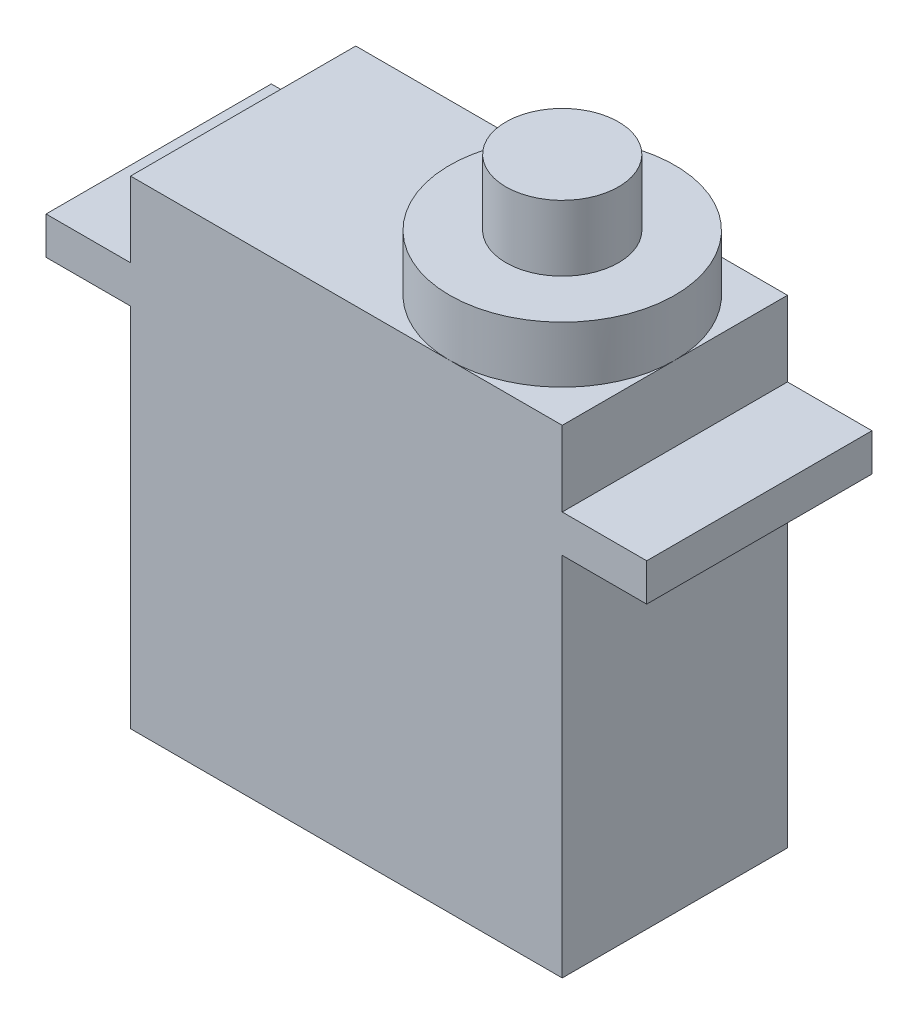
ISO-10303-21;
HEADER;
FILE_DESCRIPTION(('STEP AP214'),'2;1');
FILE_NAME('part.step','',(''),(''),'','','');
FILE_SCHEMA(('AUTOMOTIVE_DESIGN { 1 0 10303 214 1 1 1 1 }'));
ENDSEC;
DATA;
#1=APPLICATION_CONTEXT('core data for automotive mechanical design processes');
#2=APPLICATION_PROTOCOL_DEFINITION('international standard','automotive_design',2000,#1);
#3=PRODUCT_CONTEXT('',#1,'mechanical');
#4=PRODUCT('Part','Part','',(#3));
#5=PRODUCT_RELATED_PRODUCT_CATEGORY('part','',(#4));
#6=PRODUCT_DEFINITION_FORMATION('','',#4);
#7=PRODUCT_DEFINITION_CONTEXT('part definition',#1,'design');
#8=PRODUCT_DEFINITION('design','',#6,#7);
#9=PRODUCT_DEFINITION_SHAPE('','',#8);
#10=(LENGTH_UNIT() NAMED_UNIT(*) SI_UNIT(.MILLI.,.METRE.));
#11=(NAMED_UNIT(*) PLANE_ANGLE_UNIT() SI_UNIT($,.RADIAN.));
#12=(NAMED_UNIT(*) SI_UNIT($,.STERADIAN.) SOLID_ANGLE_UNIT());
#13=UNCERTAINTY_MEASURE_WITH_UNIT(LENGTH_MEASURE(1.E-05),#10,'distance_accuracy_value','');
#14=(GEOMETRIC_REPRESENTATION_CONTEXT(3) GLOBAL_UNCERTAINTY_ASSIGNED_CONTEXT((#13)) GLOBAL_UNIT_ASSIGNED_CONTEXT((#10,
#11,#12)) REPRESENTATION_CONTEXT('',''));
#15=CARTESIAN_POINT('',(0.,0.,0.));
#16=DIRECTION('',(0.,0.,1.));
#17=DIRECTION('',(1.,0.,0.));
#18=AXIS2_PLACEMENT_3D('',#15,#16,#17);
#19=CARTESIAN_POINT('',(0.,25.5,0.));
#20=DIRECTION('',(0.,-1.,0.));
#21=DIRECTION('',(0.,0.,-1.));
#22=AXIS2_PLACEMENT_3D('',#19,#20,#21);
#23=PLANE('',#22);
#24=CARTESIAN_POINT('',(17.,25.5,-6.));
#25=DIRECTION('',(0.,1.,0.));
#26=DIRECTION('',(0.,0.,1.));
#27=AXIS2_PLACEMENT_3D('',#24,#25,#26);
#28=CIRCLE('',#27,6.);
#29=CARTESIAN_POINT('',(17.,25.5,0.));
#30=VERTEX_POINT('',#29);
#31=CARTESIAN_POINT('',(23.,25.5,-6.));
#32=VERTEX_POINT('',#31);
#33=EDGE_CURVE('E153',#30,#32,#28,.T.);
#34=ORIENTED_EDGE('',*,*,#33,.F.);
#35=DIRECTION('',(1.,0.,0.));
#36=VECTOR('',#35,1.);
#37=CARTESIAN_POINT('',(0.,25.5,0.));
#38=LINE('',#37,#36);
#39=CARTESIAN_POINT('',(23.,25.5,0.));
#40=VERTEX_POINT('',#39);
#41=EDGE_CURVE('E141',#30,#40,#38,.T.);
#42=ORIENTED_EDGE('',*,*,#41,.T.);
#43=DIRECTION('',(0.,0.,-1.));
#44=VECTOR('',#43,1.);
#45=CARTESIAN_POINT('',(23.,25.5,0.));
#46=LINE('',#45,#44);
#47=EDGE_CURVE('E154',#40,#32,#46,.T.);
#48=ORIENTED_EDGE('',*,*,#47,.T.);
#49=EDGE_LOOP('',(#34,#42,#48));
#50=FACE_BOUND('',#49,.T.);
#51=ADVANCED_FACE('F34',(#50),#23,.F.);
#52=CARTESIAN_POINT('',(17.,25.5,-12.));
#53=VERTEX_POINT('',#52);
#54=EDGE_CURVE('E43',#32,#53,#28,.T.);
#55=ORIENTED_EDGE('',*,*,#54,.F.);
#56=CARTESIAN_POINT('',(23.,25.5,-12.));
#57=VERTEX_POINT('',#56);
#58=EDGE_CURVE('E140',#32,#57,#46,.T.);
#59=ORIENTED_EDGE('',*,*,#58,.T.);
#60=DIRECTION('',(-1.,0.,0.));
#61=VECTOR('',#60,1.);
#62=CARTESIAN_POINT('',(0.,25.5,-12.));
#63=LINE('',#62,#61);
#64=EDGE_CURVE('E168',#57,#53,#63,.T.);
#65=ORIENTED_EDGE('',*,*,#64,.T.);
#66=EDGE_LOOP('',(#55,#59,#65));
#67=FACE_BOUND('',#66,.T.);
#68=ADVANCED_FACE('F272',(#67),#23,.F.);
#69=CARTESIAN_POINT('',(0.,21.5,0.));
#70=DIRECTION('',(0.,1.,0.));
#71=DIRECTION('',(0.,0.,1.));
#72=AXIS2_PLACEMENT_3D('',#69,#70,#71);
#73=PLANE('',#72);
#74=DIRECTION('',(0.,0.,1.));
#75=VECTOR('',#74,1.);
#76=CARTESIAN_POINT('',(0.,21.5,0.));
#77=LINE('',#76,#75);
#78=CARTESIAN_POINT('',(0.,21.5,-12.));
#79=VERTEX_POINT('',#78);
#80=CARTESIAN_POINT('',(0.,21.5,0.));
#81=VERTEX_POINT('',#80);
#82=EDGE_CURVE('E171',#79,#81,#77,.T.);
#83=ORIENTED_EDGE('',*,*,#82,.F.);
#84=DIRECTION('',(1.,0.,0.));
#85=VECTOR('',#84,1.);
#86=CARTESIAN_POINT('',(0.,21.5,-12.));
#87=LINE('',#86,#85);
#88=CARTESIAN_POINT('',(-4.5,21.5,-12.));
#89=VERTEX_POINT('',#88);
#90=EDGE_CURVE('E185',#89,#79,#87,.T.);
#91=ORIENTED_EDGE('',*,*,#90,.F.);
#92=DIRECTION('',(0.,0.,-1.));
#93=VECTOR('',#92,1.);
#94=CARTESIAN_POINT('',(-4.5,21.5,0.));
#95=LINE('',#94,#93);
#96=CARTESIAN_POINT('',(-4.5,21.5,0.));
#97=VERTEX_POINT('',#96);
#98=EDGE_CURVE('E188',#97,#89,#95,.T.);
#99=ORIENTED_EDGE('',*,*,#98,.F.);
#100=DIRECTION('',(-1.,0.,0.));
#101=VECTOR('',#100,1.);
#102=CARTESIAN_POINT('',(0.,21.5,0.));
#103=LINE('',#102,#101);
#104=EDGE_CURVE('E192',#81,#97,#103,.T.);
#105=ORIENTED_EDGE('',*,*,#104,.F.);
#106=EDGE_LOOP('',(#83,#91,#99,#105));
#107=FACE_BOUND('',#106,.T.);
#108=ADVANCED_FACE('F266',(#107),#73,.T.);
#109=CARTESIAN_POINT('',(0.,19.5,0.));
#110=DIRECTION('',(1.,0.,0.));
#111=DIRECTION('',(0.,0.,-1.));
#112=AXIS2_PLACEMENT_3D('',#109,#110,#111);
#113=PLANE('',#112);
#114=DIRECTION('',(0.,0.,1.));
#115=VECTOR('',#114,1.);
#116=CARTESIAN_POINT('',(0.,0.,0.));
#117=LINE('',#116,#115);
#118=CARTESIAN_POINT('',(0.,0.,-12.));
#119=VERTEX_POINT('',#118);
#120=CARTESIAN_POINT('',(0.,0.,0.));
#121=VERTEX_POINT('',#120);
#122=EDGE_CURVE('E221',#119,#121,#117,.T.);
#123=ORIENTED_EDGE('',*,*,#122,.T.);
#124=DIRECTION('',(0.,-1.,0.));
#125=VECTOR('',#124,1.);
#126=CARTESIAN_POINT('',(0.,19.5,0.));
#127=LINE('',#126,#125);
#128=CARTESIAN_POINT('',(0.,19.5,0.));
#129=VERTEX_POINT('',#128);
#130=EDGE_CURVE('E38',#129,#121,#127,.T.);
#131=ORIENTED_EDGE('',*,*,#130,.F.);
#132=DIRECTION('',(0.,0.,1.));
#133=VECTOR('',#132,1.);
#134=CARTESIAN_POINT('',(0.,19.5,0.));
#135=LINE('',#134,#133);
#136=CARTESIAN_POINT('',(0.,19.5,-12.));
#137=VERTEX_POINT('',#136);
#138=EDGE_CURVE('E222',#137,#129,#135,.T.);
#139=ORIENTED_EDGE('',*,*,#138,.F.);
#140=DIRECTION('',(0.,-1.,0.));
#141=VECTOR('',#140,1.);
#142=CARTESIAN_POINT('',(0.,19.5,-12.));
#143=LINE('',#142,#141);
#144=EDGE_CURVE('E229',#137,#119,#143,.T.);
#145=ORIENTED_EDGE('',*,*,#144,.T.);
#146=EDGE_LOOP('',(#123,#131,#139,#145));
#147=FACE_BOUND('',#146,.T.);
#148=ADVANCED_FACE('F36',(#147),#113,.F.);
#149=CARTESIAN_POINT('',(0.,19.5,0.));
#150=DIRECTION('',(0.,0.,-1.));
#151=DIRECTION('',(-1.,0.,0.));
#152=AXIS2_PLACEMENT_3D('',#149,#150,#151);
#153=PLANE('',#152);
#154=DIRECTION('',(1.,0.,0.));
#155=VECTOR('',#154,1.);
#156=CARTESIAN_POINT('',(0.,0.,0.));
#157=LINE('',#156,#155);
#158=CARTESIAN_POINT('',(23.,0.,0.));
#159=VERTEX_POINT('',#158);
#160=EDGE_CURVE('E232',#121,#159,#157,.T.);
#161=ORIENTED_EDGE('',*,*,#160,.T.);
#162=DIRECTION('',(0.,-1.,0.));
#163=VECTOR('',#162,1.);
#164=CARTESIAN_POINT('',(23.,19.5,0.));
#165=LINE('',#164,#163);
#166=CARTESIAN_POINT('',(23.,19.5,0.));
#167=VERTEX_POINT('',#166);
#168=EDGE_CURVE('E161',#167,#159,#165,.T.);
#169=ORIENTED_EDGE('',*,*,#168,.F.);
#170=DIRECTION('',(-1.,0.,0.));
#171=VECTOR('',#170,1.);
#172=CARTESIAN_POINT('',(0.,19.5,0.));
#173=LINE('',#172,#171);
#174=CARTESIAN_POINT('',(27.5,19.5,0.));
#175=VERTEX_POINT('',#174);
#176=EDGE_CURVE('E206',#175,#167,#173,.T.);
#177=ORIENTED_EDGE('',*,*,#176,.F.);
#178=DIRECTION('',(0.,-1.,0.));
#179=VECTOR('',#178,1.);
#180=CARTESIAN_POINT('',(27.5,21.5,0.));
#181=LINE('',#180,#179);
#182=CARTESIAN_POINT('',(27.5,21.5,0.));
#183=VERTEX_POINT('',#182);
#184=EDGE_CURVE('E214',#183,#175,#181,.T.);
#185=ORIENTED_EDGE('',*,*,#184,.F.);
#186=CARTESIAN_POINT('',(23.,21.5,0.));
#187=VERTEX_POINT('',#186);
#188=EDGE_CURVE('E193',#183,#187,#103,.T.);
#189=ORIENTED_EDGE('',*,*,#188,.T.);
#190=DIRECTION('',(0.,-1.,0.));
#191=VECTOR('',#190,1.);
#192=CARTESIAN_POINT('',(23.,25.5,0.));
#193=LINE('',#192,#191);
#194=EDGE_CURVE('E148',#40,#187,#193,.T.);
#195=ORIENTED_EDGE('',*,*,#194,.F.);
#196=ORIENTED_EDGE('',*,*,#41,.F.);
#197=CARTESIAN_POINT('',(0.,25.5,0.));
#198=VERTEX_POINT('',#197);
#199=EDGE_CURVE('E132',#198,#30,#38,.T.);
#200=ORIENTED_EDGE('',*,*,#199,.F.);
#201=DIRECTION('',(0.,-1.,0.));
#202=VECTOR('',#201,1.);
#203=CARTESIAN_POINT('',(0.,25.5,0.));
#204=LINE('',#203,#202);
#205=EDGE_CURVE('E182',#198,#81,#204,.T.);
#206=ORIENTED_EDGE('',*,*,#205,.T.);
#207=ORIENTED_EDGE('',*,*,#104,.T.);
#208=DIRECTION('',(0.,-1.,0.));
#209=VECTOR('',#208,1.);
#210=CARTESIAN_POINT('',(-4.5,21.5,0.));
#211=LINE('',#210,#209);
#212=CARTESIAN_POINT('',(-4.5,19.5,0.));
#213=VERTEX_POINT('',#212);
#214=EDGE_CURVE('E216',#97,#213,#211,.T.);
#215=ORIENTED_EDGE('',*,*,#214,.T.);
#216=EDGE_CURVE('E205',#129,#213,#173,.T.);
#217=ORIENTED_EDGE('',*,*,#216,.F.);
#218=ORIENTED_EDGE('',*,*,#130,.T.);
#219=EDGE_LOOP('',(#161,#169,#177,#185,#189,#195,#196,#200,#206,#207,#215,#217,#218));
#220=FACE_BOUND('',#219,.T.);
#221=ADVANCED_FACE('F145',(#220),#153,.F.);
#222=CARTESIAN_POINT('',(23.,19.5,0.));
#223=DIRECTION('',(-1.,0.,0.));
#224=DIRECTION('',(0.,0.,1.));
#225=AXIS2_PLACEMENT_3D('',#222,#223,#224);
#226=PLANE('',#225);
#227=DIRECTION('',(0.,0.,-1.));
#228=VECTOR('',#227,1.);
#229=CARTESIAN_POINT('',(23.,0.,0.));
#230=LINE('',#229,#228);
#231=CARTESIAN_POINT('',(23.,0.,-12.));
#232=VERTEX_POINT('',#231);
#233=EDGE_CURVE('E234',#159,#232,#230,.T.);
#234=ORIENTED_EDGE('',*,*,#233,.T.);
#235=DIRECTION('',(0.,-1.,0.));
#236=VECTOR('',#235,1.);
#237=CARTESIAN_POINT('',(23.,19.5,-12.));
#238=LINE('',#237,#236);
#239=CARTESIAN_POINT('',(23.,19.5,-12.));
#240=VERTEX_POINT('',#239);
#241=EDGE_CURVE('E239',#240,#232,#238,.T.);
#242=ORIENTED_EDGE('',*,*,#241,.F.);
#243=DIRECTION('',(0.,0.,-1.));
#244=VECTOR('',#243,1.);
#245=CARTESIAN_POINT('',(23.,19.5,0.));
#246=LINE('',#245,#244);
#247=EDGE_CURVE('E225',#167,#240,#246,.T.);
#248=ORIENTED_EDGE('',*,*,#247,.F.);
#249=ORIENTED_EDGE('',*,*,#168,.T.);
#250=EDGE_LOOP('',(#234,#242,#248,#249));
#251=FACE_BOUND('',#250,.T.);
#252=ADVANCED_FACE('F245',(#251),#226,.F.);
#253=CARTESIAN_POINT('',(0.,19.5,-12.));
#254=DIRECTION('',(0.,0.,1.));
#255=DIRECTION('',(1.,0.,0.));
#256=AXIS2_PLACEMENT_3D('',#253,#254,#255);
#257=PLANE('',#256);
#258=DIRECTION('',(-1.,0.,0.));
#259=VECTOR('',#258,1.);
#260=CARTESIAN_POINT('',(0.,0.,-12.));
#261=LINE('',#260,#259);
#262=EDGE_CURVE('E226',#232,#119,#261,.T.);
#263=ORIENTED_EDGE('',*,*,#262,.T.);
#264=ORIENTED_EDGE('',*,*,#144,.F.);
#265=DIRECTION('',(1.,0.,0.));
#266=VECTOR('',#265,1.);
#267=CARTESIAN_POINT('',(0.,19.5,-12.));
#268=LINE('',#267,#266);
#269=CARTESIAN_POINT('',(-4.5,19.5,-12.));
#270=VERTEX_POINT('',#269);
#271=EDGE_CURVE('E199',#270,#137,#268,.T.);
#272=ORIENTED_EDGE('',*,*,#271,.F.);
#273=DIRECTION('',(0.,-1.,0.));
#274=VECTOR('',#273,1.);
#275=CARTESIAN_POINT('',(-4.5,21.5,-12.));
#276=LINE('',#275,#274);
#277=EDGE_CURVE('E219',#89,#270,#276,.T.);
#278=ORIENTED_EDGE('',*,*,#277,.F.);
#279=ORIENTED_EDGE('',*,*,#90,.T.);
#280=DIRECTION('',(0.,-1.,0.));
#281=VECTOR('',#280,1.);
#282=CARTESIAN_POINT('',(0.,25.5,-12.));
#283=LINE('',#282,#281);
#284=CARTESIAN_POINT('',(0.,25.5,-12.));
#285=VERTEX_POINT('',#284);
#286=EDGE_CURVE('E170',#285,#79,#283,.T.);
#287=ORIENTED_EDGE('',*,*,#286,.F.);
#288=EDGE_CURVE('E167',#53,#285,#63,.T.);
#289=ORIENTED_EDGE('',*,*,#288,.F.);
#290=ORIENTED_EDGE('',*,*,#64,.F.);
#291=DIRECTION('',(0.,-1.,0.));
#292=VECTOR('',#291,1.);
#293=CARTESIAN_POINT('',(23.,25.5,-12.));
#294=LINE('',#293,#292);
#295=CARTESIAN_POINT('',(23.,21.5,-12.));
#296=VERTEX_POINT('',#295);
#297=EDGE_CURVE('E178',#57,#296,#294,.T.);
#298=ORIENTED_EDGE('',*,*,#297,.T.);
#299=CARTESIAN_POINT('',(27.5,21.5,-12.));
#300=VERTEX_POINT('',#299);
#301=EDGE_CURVE('E189',#296,#300,#87,.T.);
#302=ORIENTED_EDGE('',*,*,#301,.T.);
#303=DIRECTION('',(0.,-1.,0.));
#304=VECTOR('',#303,1.);
#305=CARTESIAN_POINT('',(27.5,21.5,-12.));
#306=LINE('',#305,#304);
#307=CARTESIAN_POINT('',(27.5,19.5,-12.));
#308=VERTEX_POINT('',#307);
#309=EDGE_CURVE('E198',#300,#308,#306,.T.);
#310=ORIENTED_EDGE('',*,*,#309,.T.);
#311=EDGE_CURVE('E184',#240,#308,#268,.T.);
#312=ORIENTED_EDGE('',*,*,#311,.F.);
#313=ORIENTED_EDGE('',*,*,#241,.T.);
#314=EDGE_LOOP('',(#263,#264,#272,#278,#279,#287,#289,#290,#298,#302,#310,#312,#313));
#315=FACE_BOUND('',#314,.T.);
#316=ADVANCED_FACE('F252',(#315),#257,.F.);
#317=CARTESIAN_POINT('',(0.,0.,0.));
#318=DIRECTION('',(0.,-1.,0.));
#319=DIRECTION('',(0.,0.,-1.));
#320=AXIS2_PLACEMENT_3D('',#317,#318,#319);
#321=PLANE('',#320);
#322=ORIENTED_EDGE('',*,*,#122,.F.);
#323=ORIENTED_EDGE('',*,*,#262,.F.);
#324=ORIENTED_EDGE('',*,*,#233,.F.);
#325=ORIENTED_EDGE('',*,*,#160,.F.);
#326=EDGE_LOOP('',(#322,#323,#324,#325));
#327=FACE_BOUND('',#326,.T.);
#328=ADVANCED_FACE('F250',(#327),#321,.T.);
#329=CARTESIAN_POINT('',(0.,19.5,0.));
#330=DIRECTION('',(0.,1.,0.));
#331=DIRECTION('',(0.,0.,1.));
#332=AXIS2_PLACEMENT_3D('',#329,#330,#331);
#333=PLANE('',#332);
#334=ORIENTED_EDGE('',*,*,#271,.T.);
#335=ORIENTED_EDGE('',*,*,#138,.T.);
#336=ORIENTED_EDGE('',*,*,#216,.T.);
#337=DIRECTION('',(0.,0.,-1.));
#338=VECTOR('',#337,1.);
#339=CARTESIAN_POINT('',(-4.5,19.5,0.));
#340=LINE('',#339,#338);
#341=EDGE_CURVE('E202',#213,#270,#340,.T.);
#342=ORIENTED_EDGE('',*,*,#341,.T.);
#343=EDGE_LOOP('',(#334,#335,#336,#342));
#344=FACE_BOUND('',#343,.T.);
#345=ADVANCED_FACE('F259',(#344),#333,.F.);
#346=ORIENTED_EDGE('',*,*,#176,.T.);
#347=ORIENTED_EDGE('',*,*,#247,.T.);
#348=ORIENTED_EDGE('',*,*,#311,.T.);
#349=DIRECTION('',(0.,0.,1.));
#350=VECTOR('',#349,1.);
#351=CARTESIAN_POINT('',(27.5,19.5,0.));
#352=LINE('',#351,#350);
#353=EDGE_CURVE('E209',#308,#175,#352,.T.);
#354=ORIENTED_EDGE('',*,*,#353,.T.);
#355=EDGE_LOOP('',(#346,#347,#348,#354));
#356=FACE_BOUND('',#355,.T.);
#357=ADVANCED_FACE('F285',(#356),#333,.F.);
#358=CARTESIAN_POINT('',(-4.5,21.5,0.));
#359=DIRECTION('',(-1.,0.,0.));
#360=DIRECTION('',(0.,0.,1.));
#361=AXIS2_PLACEMENT_3D('',#358,#359,#360);
#362=PLANE('',#361);
#363=ORIENTED_EDGE('',*,*,#341,.F.);
#364=ORIENTED_EDGE('',*,*,#214,.F.);
#365=ORIENTED_EDGE('',*,*,#98,.T.);
#366=ORIENTED_EDGE('',*,*,#277,.T.);
#367=EDGE_LOOP('',(#363,#364,#365,#366));
#368=FACE_BOUND('',#367,.T.);
#369=ADVANCED_FACE('F268',(#368),#362,.T.);
#370=CARTESIAN_POINT('',(27.5,21.5,0.));
#371=DIRECTION('',(1.,0.,0.));
#372=DIRECTION('',(0.,0.,-1.));
#373=AXIS2_PLACEMENT_3D('',#370,#371,#372);
#374=PLANE('',#373);
#375=ORIENTED_EDGE('',*,*,#353,.F.);
#376=ORIENTED_EDGE('',*,*,#309,.F.);
#377=DIRECTION('',(0.,0.,1.));
#378=VECTOR('',#377,1.);
#379=CARTESIAN_POINT('',(27.5,21.5,0.));
#380=LINE('',#379,#378);
#381=EDGE_CURVE('E195',#300,#183,#380,.T.);
#382=ORIENTED_EDGE('',*,*,#381,.T.);
#383=ORIENTED_EDGE('',*,*,#184,.T.);
#384=EDGE_LOOP('',(#375,#376,#382,#383));
#385=FACE_BOUND('',#384,.T.);
#386=ADVANCED_FACE('F281',(#385),#374,.T.);
#387=DIRECTION('',(0.,0.,-1.));
#388=VECTOR('',#387,1.);
#389=CARTESIAN_POINT('',(23.,21.5,0.));
#390=LINE('',#389,#388);
#391=EDGE_CURVE('E164',#187,#296,#390,.T.);
#392=ORIENTED_EDGE('',*,*,#391,.F.);
#393=ORIENTED_EDGE('',*,*,#188,.F.);
#394=ORIENTED_EDGE('',*,*,#381,.F.);
#395=ORIENTED_EDGE('',*,*,#301,.F.);
#396=EDGE_LOOP('',(#392,#393,#394,#395));
#397=FACE_BOUND('',#396,.T.);
#398=ADVANCED_FACE('F283',(#397),#73,.T.);
#399=CARTESIAN_POINT('',(0.,25.5,0.));
#400=DIRECTION('',(1.,0.,0.));
#401=DIRECTION('',(0.,0.,-1.));
#402=AXIS2_PLACEMENT_3D('',#399,#400,#401);
#403=PLANE('',#402);
#404=ORIENTED_EDGE('',*,*,#82,.T.);
#405=ORIENTED_EDGE('',*,*,#205,.F.);
#406=DIRECTION('',(0.,0.,1.));
#407=VECTOR('',#406,1.);
#408=CARTESIAN_POINT('',(0.,25.5,0.));
#409=LINE('',#408,#407);
#410=EDGE_CURVE('E136',#285,#198,#409,.T.);
#411=ORIENTED_EDGE('',*,*,#410,.F.);
#412=ORIENTED_EDGE('',*,*,#286,.T.);
#413=EDGE_LOOP('',(#404,#405,#411,#412));
#414=FACE_BOUND('',#413,.T.);
#415=ADVANCED_FACE('F270',(#414),#403,.F.);
#416=CARTESIAN_POINT('',(23.,25.5,0.));
#417=DIRECTION('',(-1.,0.,0.));
#418=DIRECTION('',(0.,0.,1.));
#419=AXIS2_PLACEMENT_3D('',#416,#417,#418);
#420=PLANE('',#419);
#421=ORIENTED_EDGE('',*,*,#391,.T.);
#422=ORIENTED_EDGE('',*,*,#297,.F.);
#423=ORIENTED_EDGE('',*,*,#58,.F.);
#424=ORIENTED_EDGE('',*,*,#47,.F.);
#425=ORIENTED_EDGE('',*,*,#194,.T.);
#426=EDGE_LOOP('',(#421,#422,#423,#424,#425));
#427=FACE_BOUND('',#426,.T.);
#428=ADVANCED_FACE('F275',(#427),#420,.F.);
#429=EDGE_CURVE('E51',#53,#30,#28,.T.);
#430=ORIENTED_EDGE('',*,*,#429,.F.);
#431=ORIENTED_EDGE('',*,*,#288,.T.);
#432=ORIENTED_EDGE('',*,*,#410,.T.);
#433=ORIENTED_EDGE('',*,*,#199,.T.);
#434=EDGE_LOOP('',(#430,#431,#432,#433));
#435=FACE_BOUND('',#434,.T.);
#436=ADVANCED_FACE('F134',(#435),#23,.F.);
#437=CARTESIAN_POINT('',(17.,28.5,-6.));
#438=DIRECTION('',(0.,-1.,0.));
#439=DIRECTION('',(0.,0.,-1.));
#440=AXIS2_PLACEMENT_3D('',#437,#438,#439);
#441=CYLINDRICAL_SURFACE('',#440,6.);
#442=CARTESIAN_POINT('',(17.,28.5,-6.));
#443=DIRECTION('',(0.,1.,0.));
#444=DIRECTION('',(0.,0.,1.));
#445=AXIS2_PLACEMENT_3D('',#442,#443,#444);
#446=CIRCLE('',#445,6.);
#447=CARTESIAN_POINT('',(17.,28.5,0.));
#448=VERTEX_POINT('',#447);
#449=EDGE_CURVE('E156',#448,#448,#446,.T.);
#450=ORIENTED_EDGE('',*,*,#449,.F.);
#451=EDGE_LOOP('',(#450));
#452=FACE_BOUND('',#451,.T.);
#453=ORIENTED_EDGE('',*,*,#33,.T.);
#454=ORIENTED_EDGE('',*,*,#54,.T.);
#455=ORIENTED_EDGE('',*,*,#429,.T.);
#456=EDGE_LOOP('',(#453,#454,#455));
#457=FACE_BOUND('',#456,.T.);
#458=ADVANCED_FACE('F159',(#452,#457),#441,.T.);
#459=CARTESIAN_POINT('',(0.,28.5,0.));
#460=DIRECTION('',(0.,1.,0.));
#461=DIRECTION('',(0.,0.,1.));
#462=AXIS2_PLACEMENT_3D('',#459,#460,#461);
#463=PLANE('',#462);
#464=CARTESIAN_POINT('',(17.,28.5,-6.));
#465=DIRECTION('',(0.,1.,0.));
#466=DIRECTION('',(0.,0.,1.));
#467=AXIS2_PLACEMENT_3D('',#464,#465,#466);
#468=CIRCLE('',#467,3.);
#469=CARTESIAN_POINT('',(17.,28.5,-3.));
#470=VERTEX_POINT('',#469);
#471=EDGE_CURVE('E11',#470,#470,#468,.T.);
#472=ORIENTED_EDGE('',*,*,#471,.F.);
#473=EDGE_LOOP('',(#472));
#474=FACE_BOUND('',#473,.T.);
#475=ORIENTED_EDGE('',*,*,#449,.T.);
#476=EDGE_LOOP('',(#475));
#477=FACE_BOUND('',#476,.T.);
#478=ADVANCED_FACE('F307',(#474,#477),#463,.T.);
#479=CARTESIAN_POINT('',(17.,32.,-6.));
#480=DIRECTION('',(0.,-1.,0.));
#481=DIRECTION('',(0.,0.,-1.));
#482=AXIS2_PLACEMENT_3D('',#479,#480,#481);
#483=CYLINDRICAL_SURFACE('',#482,3.);
#484=CARTESIAN_POINT('',(17.,32.,-6.));
#485=DIRECTION('',(0.,1.,0.));
#486=DIRECTION('',(0.,0.,1.));
#487=AXIS2_PLACEMENT_3D('',#484,#485,#486);
#488=CIRCLE('',#487,3.);
#489=CARTESIAN_POINT('',(17.,32.,-3.));
#490=VERTEX_POINT('',#489);
#491=EDGE_CURVE('E157',#490,#490,#488,.T.);
#492=ORIENTED_EDGE('',*,*,#491,.F.);
#493=EDGE_LOOP('',(#492));
#494=FACE_BOUND('',#493,.T.);
#495=ORIENTED_EDGE('',*,*,#471,.T.);
#496=EDGE_LOOP('',(#495));
#497=FACE_BOUND('',#496,.T.);
#498=ADVANCED_FACE('F424',(#494,#497),#483,.T.);
#499=CARTESIAN_POINT('',(17.,32.,-6.));
#500=DIRECTION('',(0.,1.,0.));
#501=DIRECTION('',(0.,0.,1.));
#502=AXIS2_PLACEMENT_3D('',#499,#500,#501);
#503=PLANE('',#502);
#504=ORIENTED_EDGE('',*,*,#491,.T.);
#505=EDGE_LOOP('',(#504));
#506=FACE_BOUND('',#505,.T.);
#507=ADVANCED_FACE('F434',(#506),#503,.T.);
#508=CLOSED_SHELL('',(#51,#68,#108,#148,#221,#252,#316,#328,#345,#357,#369,#386,#398,#415,#428,
#436,#458,#478,#498,#507));
#509=MANIFOLD_SOLID_BREP('B2',#508);
#510=ADVANCED_BREP_SHAPE_REPRESENTATION('',(#18,#509),#14);
#511=SHAPE_DEFINITION_REPRESENTATION(#9,#510);
ENDSEC;
END-ISO-10303-21;
